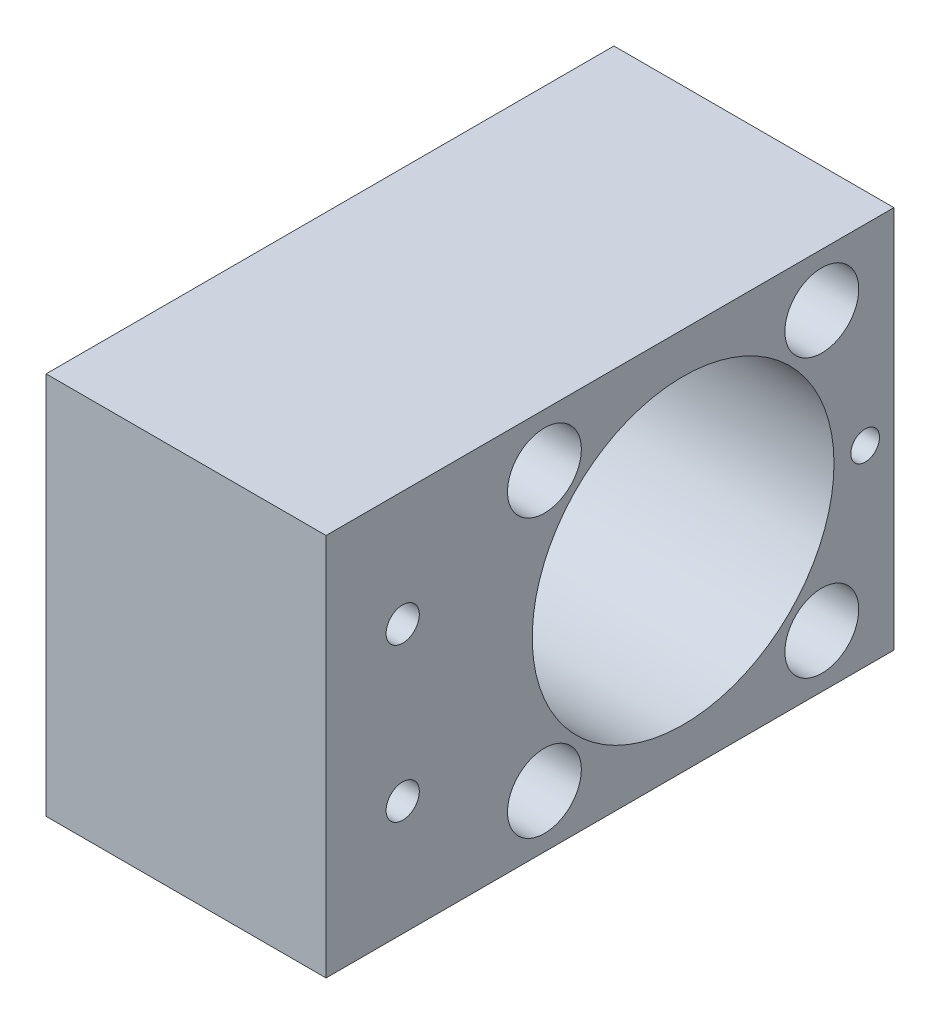
ISO-10303-21;
HEADER;
FILE_DESCRIPTION(('STEP AP214'),'2;1');
FILE_NAME('part.step','',(''),(''),'','','');
FILE_SCHEMA(('AUTOMOTIVE_DESIGN { 1 0 10303 214 1 1 1 1 }'));
ENDSEC;
DATA;
#1=APPLICATION_CONTEXT('core data for automotive mechanical design processes');
#2=APPLICATION_PROTOCOL_DEFINITION('international standard','automotive_design',2000,#1);
#3=PRODUCT_CONTEXT('',#1,'mechanical');
#4=PRODUCT('Part','Part','',(#3));
#5=PRODUCT_RELATED_PRODUCT_CATEGORY('part','',(#4));
#6=PRODUCT_DEFINITION_FORMATION('','',#4);
#7=PRODUCT_DEFINITION_CONTEXT('part definition',#1,'design');
#8=PRODUCT_DEFINITION('design','',#6,#7);
#9=PRODUCT_DEFINITION_SHAPE('','',#8);
#10=(LENGTH_UNIT() NAMED_UNIT(*) SI_UNIT(.MILLI.,.METRE.));
#11=(NAMED_UNIT(*) PLANE_ANGLE_UNIT() SI_UNIT($,.RADIAN.));
#12=(NAMED_UNIT(*) SI_UNIT($,.STERADIAN.) SOLID_ANGLE_UNIT());
#13=UNCERTAINTY_MEASURE_WITH_UNIT(LENGTH_MEASURE(1.E-05),#10,'distance_accuracy_value','');
#14=(GEOMETRIC_REPRESENTATION_CONTEXT(3) GLOBAL_UNCERTAINTY_ASSIGNED_CONTEXT((#13)) GLOBAL_UNIT_ASSIGNED_CONTEXT((#10,
#11,#12)) REPRESENTATION_CONTEXT('',''));
#15=CARTESIAN_POINT('',(0.,0.,0.));
#16=DIRECTION('',(0.,0.,1.));
#17=DIRECTION('',(1.,0.,0.));
#18=AXIS2_PLACEMENT_3D('',#15,#16,#17);
#19=CARTESIAN_POINT('',(-139.1281102758,269.617904210649,450.730144147963));
#20=DIRECTION('',(0.,1.,0.));
#21=DIRECTION('',(-1.,0.,0.));
#22=AXIS2_PLACEMENT_3D('',#19,#20,#21);
#23=PLANE('',#22);
#24=DIRECTION('',(0.,0.,1.));
#25=VECTOR('',#24,1.);
#26=CARTESIAN_POINT('',(-25.6169883433782,269.617904210649,450.730144147961));
#27=LINE('',#26,#25);
#28=CARTESIAN_POINT('',(-25.6169883433829,269.617904210649,201.272194935811));
#29=VERTEX_POINT('',#28);
#30=CARTESIAN_POINT('',(-25.6169883433808,269.617904210649,295.360051763123));
#31=VERTEX_POINT('',#30);
#32=EDGE_CURVE('E189',#29,#31,#27,.T.);
#33=ORIENTED_EDGE('',*,*,#32,.F.);
#34=DIRECTION('',(1.,0.,0.));
#35=VECTOR('',#34,1.);
#36=CARTESIAN_POINT('',(-139.128110275802,269.617904210649,201.272194935812));
#37=LINE('',#36,#35);
#38=CARTESIAN_POINT('',(20.7701366566122,269.617904210649,201.27219493581));
#39=VERTEX_POINT('',#38);
#40=EDGE_CURVE('E39',#29,#39,#37,.T.);
#41=ORIENTED_EDGE('',*,*,#40,.T.);
#42=DIRECTION('',(0.,0.,1.));
#43=VECTOR('',#42,1.);
#44=CARTESIAN_POINT('',(20.7701366566148,269.617904210649,450.730144147961));
#45=LINE('',#44,#43);
#46=CARTESIAN_POINT('',(20.7701366566132,269.617904210649,295.360051763122));
#47=VERTEX_POINT('',#46);
#48=EDGE_CURVE('E179',#39,#47,#45,.T.);
#49=ORIENTED_EDGE('',*,*,#48,.T.);
#50=DIRECTION('',(1.,0.,0.));
#51=VECTOR('',#50,1.);
#52=CARTESIAN_POINT('',(-139.128110275801,269.617904210649,295.360051763124));
#53=LINE('',#52,#51);
#54=EDGE_CURVE('E74',#31,#47,#53,.T.);
#55=ORIENTED_EDGE('',*,*,#54,.F.);
#56=EDGE_LOOP('',(#33,#41,#49,#55));
#57=FACE_BOUND('',#56,.T.);
#58=ADVANCED_FACE('F35',(#57),#23,.F.);
#59=CARTESIAN_POINT('',(-139.128110275801,31.4929042106494,295.360051763124));
#60=DIRECTION('',(0.,0.,-1.));
#61=DIRECTION('',(-1.,0.,0.));
#62=AXIS2_PLACEMENT_3D('',#59,#60,#61);
#63=PLANE('',#62);
#64=DIRECTION('',(0.,1.,0.));
#65=VECTOR('',#64,1.);
#66=CARTESIAN_POINT('',(-25.616988343384,31.492904210648,295.360051763123));
#67=LINE('',#66,#65);
#68=CARTESIAN_POINT('',(-25.6169883433813,333.117904210649,295.360051763123));
#69=VERTEX_POINT('',#68);
#70=EDGE_CURVE('E44',#31,#69,#67,.T.);
#71=ORIENTED_EDGE('',*,*,#70,.F.);
#72=ORIENTED_EDGE('',*,*,#54,.T.);
#73=DIRECTION('',(0.,1.,0.));
#74=VECTOR('',#73,1.);
#75=CARTESIAN_POINT('',(20.7701366566132,31.4929042106494,295.360051763122));
#76=LINE('',#75,#74);
#77=CARTESIAN_POINT('',(20.7701366566131,333.117904210649,295.360051763122));
#78=VERTEX_POINT('',#77);
#79=EDGE_CURVE('E177',#47,#78,#76,.T.);
#80=ORIENTED_EDGE('',*,*,#79,.T.);
#81=DIRECTION('',(1.,0.,0.));
#82=VECTOR('',#81,1.);
#83=CARTESIAN_POINT('',(-139.128110275801,333.117904210649,295.360051763124));
#84=LINE('',#83,#82);
#85=EDGE_CURVE('E176',#69,#78,#84,.T.);
#86=ORIENTED_EDGE('',*,*,#85,.F.);
#87=EDGE_LOOP('',(#71,#72,#80,#86));
#88=FACE_BOUND('',#87,.T.);
#89=ADVANCED_FACE('F199',(#88),#63,.F.);
#90=CARTESIAN_POINT('',(-139.1281102758,333.117904210649,450.730144147963));
#91=DIRECTION('',(0.,-1.,0.));
#92=DIRECTION('',(1.,0.,0.));
#93=AXIS2_PLACEMENT_3D('',#90,#91,#92);
#94=PLANE('',#93);
#95=DIRECTION('',(0.,0.,-1.));
#96=VECTOR('',#95,1.);
#97=CARTESIAN_POINT('',(-25.6169883433775,333.117904210649,450.730144147961));
#98=LINE('',#97,#96);
#99=CARTESIAN_POINT('',(-25.6169883433826,333.117904210649,201.272194935811));
#100=VERTEX_POINT('',#99);
#101=EDGE_CURVE('E11',#69,#100,#98,.T.);
#102=ORIENTED_EDGE('',*,*,#101,.F.);
#103=ORIENTED_EDGE('',*,*,#85,.T.);
#104=DIRECTION('',(0.,0.,-1.));
#105=VECTOR('',#104,1.);
#106=CARTESIAN_POINT('',(20.7701366566148,333.117904210649,450.730144147961));
#107=LINE('',#106,#105);
#108=CARTESIAN_POINT('',(20.7701366566122,333.117904210649,201.27219493581));
#109=VERTEX_POINT('',#108);
#110=EDGE_CURVE('E174',#78,#109,#107,.T.);
#111=ORIENTED_EDGE('',*,*,#110,.T.);
#112=DIRECTION('',(1.,0.,0.));
#113=VECTOR('',#112,1.);
#114=CARTESIAN_POINT('',(-139.128110275802,333.117904210649,201.272194935812));
#115=LINE('',#114,#113);
#116=EDGE_CURVE('E57',#100,#109,#115,.T.);
#117=ORIENTED_EDGE('',*,*,#116,.F.);
#118=EDGE_LOOP('',(#102,#103,#111,#117));
#119=FACE_BOUND('',#118,.T.);
#120=ADVANCED_FACE('F196',(#119),#94,.F.);
#121=CARTESIAN_POINT('',(-139.128110275802,31.4929042106494,201.272194935812));
#122=DIRECTION('',(0.,0.,1.));
#123=DIRECTION('',(1.,0.,0.));
#124=AXIS2_PLACEMENT_3D('',#121,#122,#123);
#125=PLANE('',#124);
#126=DIRECTION('',(0.,-1.,0.));
#127=VECTOR('',#126,1.);
#128=CARTESIAN_POINT('',(-25.6169883433858,31.492904210648,201.272194935811));
#129=LINE('',#128,#127);
#130=EDGE_CURVE('E186',#100,#29,#129,.T.);
#131=ORIENTED_EDGE('',*,*,#130,.F.);
#132=ORIENTED_EDGE('',*,*,#116,.T.);
#133=DIRECTION('',(0.,-1.,0.));
#134=VECTOR('',#133,1.);
#135=CARTESIAN_POINT('',(20.7701366566122,31.4929042106494,201.27219493581));
#136=LINE('',#135,#134);
#137=EDGE_CURVE('E171',#109,#39,#136,.T.);
#138=ORIENTED_EDGE('',*,*,#137,.T.);
#139=ORIENTED_EDGE('',*,*,#40,.F.);
#140=EDGE_LOOP('',(#131,#132,#138,#139));
#141=FACE_BOUND('',#140,.T.);
#142=ADVANCED_FACE('F203',(#141),#125,.F.);
#143=CARTESIAN_POINT('',(-139.128110275802,301.367904210649,236.197194935812));
#144=DIRECTION('',(1.,0.,0.));
#145=DIRECTION('',(0.,0.,-1.));
#146=AXIS2_PLACEMENT_3D('',#143,#144,#145);
#147=CYLINDRICAL_SURFACE('',#146,25.);
#148=CARTESIAN_POINT('',(20.7701366566125,301.367904210649,236.19719493581));
#149=DIRECTION('',(1.,0.,0.));
#150=DIRECTION('',(0.,0.,-1.));
#151=AXIS2_PLACEMENT_3D('',#148,#149,#150);
#152=CIRCLE('',#151,25.);
#153=CARTESIAN_POINT('',(20.7701366566123,301.367904210649,211.19719493581));
#154=VERTEX_POINT('',#153);
#155=EDGE_CURVE('E173',#154,#154,#152,.T.);
#156=ORIENTED_EDGE('',*,*,#155,.T.);
#157=EDGE_LOOP('',(#156));
#158=FACE_BOUND('',#157,.T.);
#159=CARTESIAN_POINT('',(-25.6169883433819,301.367904210649,236.197194935811));
#160=DIRECTION('',(-1.,0.,0.));
#161=DIRECTION('',(0.,0.,1.));
#162=AXIS2_PLACEMENT_3D('',#159,#160,#161);
#163=CIRCLE('',#162,25.);
#164=CARTESIAN_POINT('',(-25.6169883433814,301.367904210649,261.197194935811));
#165=VERTEX_POINT('',#164);
#166=EDGE_CURVE('E184',#165,#165,#163,.F.);
#167=ORIENTED_EDGE('',*,*,#166,.F.);
#168=EDGE_LOOP('',(#167));
#169=FACE_BOUND('',#168,.T.);
#170=ADVANCED_FACE('F205',(#158,#169),#147,.F.);
#171=CARTESIAN_POINT('',(20.7701366566101,0.,-2.18969740989699E-13));
#172=DIRECTION('',(-1.,0.,0.));
#173=DIRECTION('',(0.,0.,1.));
#174=AXIS2_PLACEMENT_3D('',#171,#172,#173);
#175=PLANE('',#174);
#176=CARTESIAN_POINT('',(20.7701366566122,301.367904210649,206.034694935811));
#177=DIRECTION('',(1.,0.,0.));
#178=DIRECTION('',(0.,0.,-1.));
#179=AXIS2_PLACEMENT_3D('',#176,#177,#178);
#180=CIRCLE('',#179,2.38125);
#181=CARTESIAN_POINT('',(20.7701366566122,301.367904210649,203.653444935811));
#182=VERTEX_POINT('',#181);
#183=EDGE_CURVE('E95',#182,#182,#180,.T.);
#184=ORIENTED_EDGE('',*,*,#183,.F.);
#185=EDGE_LOOP('',(#184));
#186=FACE_BOUND('',#185,.T.);
#187=CARTESIAN_POINT('',(20.7701366566152,314.06790421065,282.660051763122));
#188=DIRECTION('',(-1.,0.,0.));
#189=DIRECTION('',(0.,0.,1.));
#190=AXIS2_PLACEMENT_3D('',#187,#188,#189);
#191=CIRCLE('',#190,2.74999999999997);
#192=CARTESIAN_POINT('',(20.7701366566153,314.06790421065,285.410051763122));
#193=VERTEX_POINT('',#192);
#194=EDGE_CURVE('E108',#193,#193,#191,.T.);
#195=ORIENTED_EDGE('',*,*,#194,.T.);
#196=EDGE_LOOP('',(#195));
#197=FACE_BOUND('',#196,.T.);
#198=CARTESIAN_POINT('',(20.7701366566149,288.66790421065,282.660051763122));
#199=DIRECTION('',(-1.,0.,0.));
#200=DIRECTION('',(0.,0.,1.));
#201=AXIS2_PLACEMENT_3D('',#198,#199,#200);
#202=CIRCLE('',#201,2.74999999999997);
#203=CARTESIAN_POINT('',(20.770136656615,288.66790421065,285.410051763122));
#204=VERTEX_POINT('',#203);
#205=EDGE_CURVE('E120',#204,#204,#202,.T.);
#206=ORIENTED_EDGE('',*,*,#205,.T.);
#207=EDGE_LOOP('',(#206));
#208=FACE_BOUND('',#207,.T.);
#209=CARTESIAN_POINT('',(20.7701366566128,324.34887459921,259.178165324371));
#210=DIRECTION('',(1.,0.,0.));
#211=DIRECTION('',(0.,0.,-1.));
#212=AXIS2_PLACEMENT_3D('',#209,#210,#211);
#213=CIRCLE('',#212,6.12000000000001);
#214=CARTESIAN_POINT('',(20.7701366566127,324.34887459921,253.058165324371));
#215=VERTEX_POINT('',#214);
#216=EDGE_CURVE('E123',#215,#215,#213,.T.);
#217=ORIENTED_EDGE('',*,*,#216,.F.);
#218=EDGE_LOOP('',(#217));
#219=FACE_BOUND('',#218,.T.);
#220=CARTESIAN_POINT('',(20.7701366566128,278.38693382209,259.178165324371));
#221=DIRECTION('',(1.,0.,0.));
#222=DIRECTION('',(0.,0.,-1.));
#223=AXIS2_PLACEMENT_3D('',#220,#221,#222);
#224=CIRCLE('',#223,6.12000000000001);
#225=CARTESIAN_POINT('',(20.7701366566127,278.38693382209,253.058165324371));
#226=VERTEX_POINT('',#225);
#227=EDGE_CURVE('E135',#226,#226,#224,.T.);
#228=ORIENTED_EDGE('',*,*,#227,.F.);
#229=EDGE_LOOP('',(#228));
#230=FACE_BOUND('',#229,.T.);
#231=CARTESIAN_POINT('',(20.7701366566123,278.38693382209,213.21622454725));
#232=DIRECTION('',(1.,0.,0.));
#233=DIRECTION('',(0.,0.,-1.));
#234=AXIS2_PLACEMENT_3D('',#231,#232,#233);
#235=CIRCLE('',#234,6.12000000000001);
#236=CARTESIAN_POINT('',(20.7701366566122,278.38693382209,207.09622454725));
#237=VERTEX_POINT('',#236);
#238=EDGE_CURVE('E147',#237,#237,#235,.T.);
#239=ORIENTED_EDGE('',*,*,#238,.F.);
#240=EDGE_LOOP('',(#239));
#241=FACE_BOUND('',#240,.T.);
#242=CARTESIAN_POINT('',(20.7701366566123,324.34887459921,213.216224547251));
#243=DIRECTION('',(1.,0.,0.));
#244=DIRECTION('',(0.,0.,-1.));
#245=AXIS2_PLACEMENT_3D('',#242,#243,#244);
#246=CIRCLE('',#245,6.12000000000001);
#247=CARTESIAN_POINT('',(20.7701366566122,324.34887459921,207.096224547251));
#248=VERTEX_POINT('',#247);
#249=EDGE_CURVE('E159',#248,#248,#246,.T.);
#250=ORIENTED_EDGE('',*,*,#249,.F.);
#251=EDGE_LOOP('',(#250));
#252=FACE_BOUND('',#251,.T.);
#253=ORIENTED_EDGE('',*,*,#155,.F.);
#254=EDGE_LOOP('',(#253));
#255=FACE_BOUND('',#254,.T.);
#256=ORIENTED_EDGE('',*,*,#48,.F.);
#257=ORIENTED_EDGE('',*,*,#137,.F.);
#258=ORIENTED_EDGE('',*,*,#110,.F.);
#259=ORIENTED_EDGE('',*,*,#79,.F.);
#260=EDGE_LOOP('',(#256,#257,#258,#259));
#261=FACE_BOUND('',#260,.T.);
#262=ADVANCED_FACE('F202',(#186,#197,#208,#219,#230,#241,#252,#255,#261),#175,.F.);
#263=CARTESIAN_POINT('',(-25.6169883433819,301.36790421065,236.197194935811));
#264=DIRECTION('',(-1.,0.,0.));
#265=DIRECTION('',(0.,0.,-1.));
#266=AXIS2_PLACEMENT_3D('',#263,#264,#265);
#267=PLANE('',#266);
#268=CARTESIAN_POINT('',(-25.6169883433809,314.06790421065,282.660051763123));
#269=DIRECTION('',(-1.,0.,0.));
#270=DIRECTION('',(0.,0.,1.));
#271=AXIS2_PLACEMENT_3D('',#268,#269,#270);
#272=CIRCLE('',#271,6.12000000000001);
#273=CARTESIAN_POINT('',(-25.6169883433808,314.06790421065,288.780051763123));
#274=VERTEX_POINT('',#273);
#275=EDGE_CURVE('E94',#274,#274,#272,.T.);
#276=ORIENTED_EDGE('',*,*,#275,.F.);
#277=EDGE_LOOP('',(#276));
#278=FACE_BOUND('',#277,.T.);
#279=CARTESIAN_POINT('',(-25.6169883433812,288.66790421065,282.660051763123));
#280=DIRECTION('',(-1.,0.,0.));
#281=DIRECTION('',(0.,0.,1.));
#282=AXIS2_PLACEMENT_3D('',#279,#280,#281);
#283=CIRCLE('',#282,6.12000000000001);
#284=CARTESIAN_POINT('',(-25.6169883433811,288.66790421065,288.780051763123));
#285=VERTEX_POINT('',#284);
#286=EDGE_CURVE('E111',#285,#285,#283,.T.);
#287=ORIENTED_EDGE('',*,*,#286,.F.);
#288=EDGE_LOOP('',(#287));
#289=FACE_BOUND('',#288,.T.);
#290=CARTESIAN_POINT('',(-25.6169883433833,324.34887459921,259.178165324371));
#291=DIRECTION('',(1.,0.,0.));
#292=DIRECTION('',(0.,0.,-1.));
#293=AXIS2_PLACEMENT_3D('',#290,#291,#292);
#294=CIRCLE('',#293,2.74999999999997);
#295=CARTESIAN_POINT('',(-25.6169883433834,324.34887459921,256.428165324371));
#296=VERTEX_POINT('',#295);
#297=EDGE_CURVE('E132',#296,#296,#294,.T.);
#298=ORIENTED_EDGE('',*,*,#297,.T.);
#299=EDGE_LOOP('',(#298));
#300=FACE_BOUND('',#299,.T.);
#301=CARTESIAN_POINT('',(-25.6169883433833,278.38693382209,259.178165324371));
#302=DIRECTION('',(1.,0.,0.));
#303=DIRECTION('',(0.,0.,-1.));
#304=AXIS2_PLACEMENT_3D('',#301,#302,#303);
#305=CIRCLE('',#304,2.74999999999997);
#306=CARTESIAN_POINT('',(-25.6169883433834,278.38693382209,256.428165324371));
#307=VERTEX_POINT('',#306);
#308=EDGE_CURVE('E144',#307,#307,#305,.T.);
#309=ORIENTED_EDGE('',*,*,#308,.T.);
#310=EDGE_LOOP('',(#309));
#311=FACE_BOUND('',#310,.T.);
#312=CARTESIAN_POINT('',(-25.6169883433838,278.38693382209,213.216224547251));
#313=DIRECTION('',(1.,0.,0.));
#314=DIRECTION('',(0.,0.,-1.));
#315=AXIS2_PLACEMENT_3D('',#312,#313,#314);
#316=CIRCLE('',#315,2.74999999999997);
#317=CARTESIAN_POINT('',(-25.6169883433838,278.38693382209,210.466224547251));
#318=VERTEX_POINT('',#317);
#319=EDGE_CURVE('E156',#318,#318,#316,.T.);
#320=ORIENTED_EDGE('',*,*,#319,.T.);
#321=EDGE_LOOP('',(#320));
#322=FACE_BOUND('',#321,.T.);
#323=CARTESIAN_POINT('',(-25.6169883433838,324.34887459921,213.216224547251));
#324=DIRECTION('',(1.,0.,0.));
#325=DIRECTION('',(0.,0.,-1.));
#326=AXIS2_PLACEMENT_3D('',#323,#324,#325);
#327=CIRCLE('',#326,2.74999999999997);
#328=CARTESIAN_POINT('',(-25.6169883433838,324.34887459921,210.466224547251));
#329=VERTEX_POINT('',#328);
#330=EDGE_CURVE('E168',#329,#329,#327,.T.);
#331=ORIENTED_EDGE('',*,*,#330,.T.);
#332=EDGE_LOOP('',(#331));
#333=FACE_BOUND('',#332,.T.);
#334=ORIENTED_EDGE('',*,*,#166,.T.);
#335=EDGE_LOOP('',(#334));
#336=FACE_BOUND('',#335,.T.);
#337=ORIENTED_EDGE('',*,*,#130,.T.);
#338=ORIENTED_EDGE('',*,*,#32,.T.);
#339=ORIENTED_EDGE('',*,*,#70,.T.);
#340=ORIENTED_EDGE('',*,*,#101,.T.);
#341=EDGE_LOOP('',(#337,#338,#339,#340));
#342=FACE_BOUND('',#341,.T.);
#343=ADVANCED_FACE('F37',(#278,#289,#300,#311,#322,#333,#336,#342),#267,.T.);
#344=CARTESIAN_POINT('',(20.7701366566123,324.34887459921,213.216224547251));
#345=DIRECTION('',(1.,0.,0.));
#346=DIRECTION('',(0.,0.,-1.));
#347=AXIS2_PLACEMENT_3D('',#344,#345,#346);
#348=CYLINDRICAL_SURFACE('',#347,2.75);
#349=ORIENTED_EDGE('',*,*,#330,.F.);
#350=EDGE_LOOP('',(#349));
#351=FACE_BOUND('',#350,.T.);
#352=CARTESIAN_POINT('',(10.7701366566123,324.34887459921,213.216224547251));
#353=DIRECTION('',(1.,0.,0.));
#354=DIRECTION('',(0.,0.,-1.));
#355=AXIS2_PLACEMENT_3D('',#352,#353,#354);
#356=CIRCLE('',#355,2.75000000000003);
#357=CARTESIAN_POINT('',(10.7701366566122,324.34887459921,210.466224547251));
#358=VERTEX_POINT('',#357);
#359=EDGE_CURVE('E165',#358,#358,#356,.T.);
#360=ORIENTED_EDGE('',*,*,#359,.T.);
#361=EDGE_LOOP('',(#360));
#362=FACE_BOUND('',#361,.T.);
#363=ADVANCED_FACE('F223',(#351,#362),#348,.F.);
#364=CARTESIAN_POINT('',(10.7701366566123,327.09887459921,213.216224547251));
#365=DIRECTION('',(-1.,0.,0.));
#366=DIRECTION('',(0.,0.,1.));
#367=AXIS2_PLACEMENT_3D('',#364,#365,#366);
#368=PLANE('',#367);
#369=ORIENTED_EDGE('',*,*,#359,.F.);
#370=EDGE_LOOP('',(#369));
#371=FACE_BOUND('',#370,.T.);
#372=CARTESIAN_POINT('',(10.7701366566123,324.34887459921,213.216224547251));
#373=DIRECTION('',(1.,0.,0.));
#374=DIRECTION('',(0.,0.,-1.));
#375=AXIS2_PLACEMENT_3D('',#372,#373,#374);
#376=CIRCLE('',#375,6.12000000000001);
#377=CARTESIAN_POINT('',(10.7701366566122,324.34887459921,207.096224547251));
#378=VERTEX_POINT('',#377);
#379=EDGE_CURVE('E162',#378,#378,#376,.T.);
#380=ORIENTED_EDGE('',*,*,#379,.T.);
#381=EDGE_LOOP('',(#380));
#382=FACE_BOUND('',#381,.T.);
#383=ADVANCED_FACE('F229',(#371,#382),#368,.F.);
#384=CARTESIAN_POINT('',(20.7701366566123,324.34887459921,213.216224547251));
#385=DIRECTION('',(1.,0.,0.));
#386=DIRECTION('',(0.,0.,-1.));
#387=AXIS2_PLACEMENT_3D('',#384,#385,#386);
#388=CYLINDRICAL_SURFACE('',#387,6.12000000000001);
#389=ORIENTED_EDGE('',*,*,#379,.F.);
#390=EDGE_LOOP('',(#389));
#391=FACE_BOUND('',#390,.T.);
#392=ORIENTED_EDGE('',*,*,#249,.T.);
#393=EDGE_LOOP('',(#392));
#394=FACE_BOUND('',#393,.T.);
#395=ADVANCED_FACE('F252',(#391,#394),#388,.F.);
#396=CARTESIAN_POINT('',(20.7701366566123,278.38693382209,213.21622454725));
#397=DIRECTION('',(1.,0.,0.));
#398=DIRECTION('',(0.,0.,-1.));
#399=AXIS2_PLACEMENT_3D('',#396,#397,#398);
#400=CYLINDRICAL_SURFACE('',#399,2.74999999999997);
#401=ORIENTED_EDGE('',*,*,#319,.F.);
#402=EDGE_LOOP('',(#401));
#403=FACE_BOUND('',#402,.T.);
#404=CARTESIAN_POINT('',(10.7701366566123,278.38693382209,213.216224547251));
#405=DIRECTION('',(1.,0.,0.));
#406=DIRECTION('',(0.,0.,-1.));
#407=AXIS2_PLACEMENT_3D('',#404,#405,#406);
#408=CIRCLE('',#407,2.74999999999997);
#409=CARTESIAN_POINT('',(10.7701366566123,278.38693382209,210.466224547251));
#410=VERTEX_POINT('',#409);
#411=EDGE_CURVE('E153',#410,#410,#408,.T.);
#412=ORIENTED_EDGE('',*,*,#411,.T.);
#413=EDGE_LOOP('',(#412));
#414=FACE_BOUND('',#413,.T.);
#415=ADVANCED_FACE('F258',(#403,#414),#400,.F.);
#416=CARTESIAN_POINT('',(10.7701366566123,281.13693382209,213.216224547251));
#417=DIRECTION('',(-1.,0.,0.));
#418=DIRECTION('',(0.,0.,1.));
#419=AXIS2_PLACEMENT_3D('',#416,#417,#418);
#420=PLANE('',#419);
#421=ORIENTED_EDGE('',*,*,#411,.F.);
#422=EDGE_LOOP('',(#421));
#423=FACE_BOUND('',#422,.T.);
#424=CARTESIAN_POINT('',(10.7701366566123,278.38693382209,213.216224547251));
#425=DIRECTION('',(1.,0.,0.));
#426=DIRECTION('',(0.,0.,-1.));
#427=AXIS2_PLACEMENT_3D('',#424,#425,#426);
#428=CIRCLE('',#427,6.12000000000001);
#429=CARTESIAN_POINT('',(10.7701366566122,278.38693382209,207.096224547251));
#430=VERTEX_POINT('',#429);
#431=EDGE_CURVE('E150',#430,#430,#428,.T.);
#432=ORIENTED_EDGE('',*,*,#431,.T.);
#433=EDGE_LOOP('',(#432));
#434=FACE_BOUND('',#433,.T.);
#435=ADVANCED_FACE('F267',(#423,#434),#420,.F.);
#436=CARTESIAN_POINT('',(20.7701366566123,278.38693382209,213.21622454725));
#437=DIRECTION('',(1.,0.,0.));
#438=DIRECTION('',(0.,0.,-1.));
#439=AXIS2_PLACEMENT_3D('',#436,#437,#438);
#440=CYLINDRICAL_SURFACE('',#439,6.12000000000001);
#441=ORIENTED_EDGE('',*,*,#431,.F.);
#442=EDGE_LOOP('',(#441));
#443=FACE_BOUND('',#442,.T.);
#444=ORIENTED_EDGE('',*,*,#238,.T.);
#445=EDGE_LOOP('',(#444));
#446=FACE_BOUND('',#445,.T.);
#447=ADVANCED_FACE('F273',(#443,#446),#440,.F.);
#448=CARTESIAN_POINT('',(20.7701366566128,278.38693382209,259.178165324371));
#449=DIRECTION('',(1.,0.,0.));
#450=DIRECTION('',(0.,0.,-1.));
#451=AXIS2_PLACEMENT_3D('',#448,#449,#450);
#452=CYLINDRICAL_SURFACE('',#451,2.74999999999997);
#453=ORIENTED_EDGE('',*,*,#308,.F.);
#454=EDGE_LOOP('',(#453));
#455=FACE_BOUND('',#454,.T.);
#456=CARTESIAN_POINT('',(10.7701366566128,278.38693382209,259.178165324371));
#457=DIRECTION('',(1.,0.,0.));
#458=DIRECTION('',(0.,0.,-1.));
#459=AXIS2_PLACEMENT_3D('',#456,#457,#458);
#460=CIRCLE('',#459,2.74999999999997);
#461=CARTESIAN_POINT('',(10.7701366566127,278.38693382209,256.428165324371));
#462=VERTEX_POINT('',#461);
#463=EDGE_CURVE('E141',#462,#462,#460,.T.);
#464=ORIENTED_EDGE('',*,*,#463,.T.);
#465=EDGE_LOOP('',(#464));
#466=FACE_BOUND('',#465,.T.);
#467=ADVANCED_FACE('F277',(#455,#466),#452,.F.);
#468=CARTESIAN_POINT('',(10.7701366566128,281.13693382209,259.178165324371));
#469=DIRECTION('',(-1.,0.,0.));
#470=DIRECTION('',(0.,0.,1.));
#471=AXIS2_PLACEMENT_3D('',#468,#469,#470);
#472=PLANE('',#471);
#473=ORIENTED_EDGE('',*,*,#463,.F.);
#474=EDGE_LOOP('',(#473));
#475=FACE_BOUND('',#474,.T.);
#476=CARTESIAN_POINT('',(10.7701366566128,278.38693382209,259.178165324371));
#477=DIRECTION('',(1.,0.,0.));
#478=DIRECTION('',(0.,0.,-1.));
#479=AXIS2_PLACEMENT_3D('',#476,#477,#478);
#480=CIRCLE('',#479,6.12000000000001);
#481=CARTESIAN_POINT('',(10.7701366566127,278.38693382209,253.058165324371));
#482=VERTEX_POINT('',#481);
#483=EDGE_CURVE('E138',#482,#482,#480,.T.);
#484=ORIENTED_EDGE('',*,*,#483,.T.);
#485=EDGE_LOOP('',(#484));
#486=FACE_BOUND('',#485,.T.);
#487=ADVANCED_FACE('F281',(#475,#486),#472,.F.);
#488=CARTESIAN_POINT('',(20.7701366566128,278.38693382209,259.178165324371));
#489=DIRECTION('',(1.,0.,0.));
#490=DIRECTION('',(0.,0.,-1.));
#491=AXIS2_PLACEMENT_3D('',#488,#489,#490);
#492=CYLINDRICAL_SURFACE('',#491,6.12000000000001);
#493=ORIENTED_EDGE('',*,*,#483,.F.);
#494=EDGE_LOOP('',(#493));
#495=FACE_BOUND('',#494,.T.);
#496=ORIENTED_EDGE('',*,*,#227,.T.);
#497=EDGE_LOOP('',(#496));
#498=FACE_BOUND('',#497,.T.);
#499=ADVANCED_FACE('F285',(#495,#498),#492,.F.);
#500=CARTESIAN_POINT('',(20.7701366566128,324.34887459921,259.178165324371));
#501=DIRECTION('',(1.,0.,0.));
#502=DIRECTION('',(0.,0.,-1.));
#503=AXIS2_PLACEMENT_3D('',#500,#501,#502);
#504=CYLINDRICAL_SURFACE('',#503,2.74999999999997);
#505=ORIENTED_EDGE('',*,*,#297,.F.);
#506=EDGE_LOOP('',(#505));
#507=FACE_BOUND('',#506,.T.);
#508=CARTESIAN_POINT('',(10.7701366566128,324.34887459921,259.178165324371));
#509=DIRECTION('',(1.,0.,0.));
#510=DIRECTION('',(0.,0.,-1.));
#511=AXIS2_PLACEMENT_3D('',#508,#509,#510);
#512=CIRCLE('',#511,2.74999999999997);
#513=CARTESIAN_POINT('',(10.7701366566127,324.34887459921,256.428165324371));
#514=VERTEX_POINT('',#513);
#515=EDGE_CURVE('E129',#514,#514,#512,.T.);
#516=ORIENTED_EDGE('',*,*,#515,.T.);
#517=EDGE_LOOP('',(#516));
#518=FACE_BOUND('',#517,.T.);
#519=ADVANCED_FACE('F289',(#507,#518),#504,.F.);
#520=CARTESIAN_POINT('',(10.7701366566128,327.09887459921,259.178165324371));
#521=DIRECTION('',(-1.,0.,0.));
#522=DIRECTION('',(0.,0.,1.));
#523=AXIS2_PLACEMENT_3D('',#520,#521,#522);
#524=PLANE('',#523);
#525=ORIENTED_EDGE('',*,*,#515,.F.);
#526=EDGE_LOOP('',(#525));
#527=FACE_BOUND('',#526,.T.);
#528=CARTESIAN_POINT('',(10.7701366566128,324.34887459921,259.178165324371));
#529=DIRECTION('',(1.,0.,0.));
#530=DIRECTION('',(0.,0.,-1.));
#531=AXIS2_PLACEMENT_3D('',#528,#529,#530);
#532=CIRCLE('',#531,6.12000000000001);
#533=CARTESIAN_POINT('',(10.7701366566127,324.34887459921,253.058165324371));
#534=VERTEX_POINT('',#533);
#535=EDGE_CURVE('E126',#534,#534,#532,.T.);
#536=ORIENTED_EDGE('',*,*,#535,.T.);
#537=EDGE_LOOP('',(#536));
#538=FACE_BOUND('',#537,.T.);
#539=ADVANCED_FACE('F293',(#527,#538),#524,.F.);
#540=CARTESIAN_POINT('',(20.7701366566128,324.34887459921,259.178165324371));
#541=DIRECTION('',(1.,0.,0.));
#542=DIRECTION('',(0.,0.,-1.));
#543=AXIS2_PLACEMENT_3D('',#540,#541,#542);
#544=CYLINDRICAL_SURFACE('',#543,6.12000000000001);
#545=ORIENTED_EDGE('',*,*,#535,.F.);
#546=EDGE_LOOP('',(#545));
#547=FACE_BOUND('',#546,.T.);
#548=ORIENTED_EDGE('',*,*,#216,.T.);
#549=EDGE_LOOP('',(#548));
#550=FACE_BOUND('',#549,.T.);
#551=ADVANCED_FACE('F297',(#547,#550),#544,.F.);
#552=CARTESIAN_POINT('',(-25.6169883433812,288.66790421065,282.660051763123));
#553=DIRECTION('',(-1.,0.,0.));
#554=DIRECTION('',(0.,0.,1.));
#555=AXIS2_PLACEMENT_3D('',#552,#553,#554);
#556=CYLINDRICAL_SURFACE('',#555,2.75);
#557=ORIENTED_EDGE('',*,*,#205,.F.);
#558=EDGE_LOOP('',(#557));
#559=FACE_BOUND('',#558,.T.);
#560=CARTESIAN_POINT('',(-15.6169883433812,288.66790421065,282.660051763123));
#561=DIRECTION('',(-1.,0.,0.));
#562=DIRECTION('',(0.,0.,1.));
#563=AXIS2_PLACEMENT_3D('',#560,#561,#562);
#564=CIRCLE('',#563,2.75000000000003);
#565=CARTESIAN_POINT('',(-15.6169883433811,288.66790421065,285.410051763123));
#566=VERTEX_POINT('',#565);
#567=EDGE_CURVE('E117',#566,#566,#564,.T.);
#568=ORIENTED_EDGE('',*,*,#567,.T.);
#569=EDGE_LOOP('',(#568));
#570=FACE_BOUND('',#569,.T.);
#571=ADVANCED_FACE('F301',(#559,#570),#556,.F.);
#572=CARTESIAN_POINT('',(-15.6169883433812,291.41790421065,282.660051763123));
#573=DIRECTION('',(1.,0.,0.));
#574=DIRECTION('',(0.,0.,-1.));
#575=AXIS2_PLACEMENT_3D('',#572,#573,#574);
#576=PLANE('',#575);
#577=ORIENTED_EDGE('',*,*,#567,.F.);
#578=EDGE_LOOP('',(#577));
#579=FACE_BOUND('',#578,.T.);
#580=CARTESIAN_POINT('',(-15.6169883433812,288.66790421065,282.660051763123));
#581=DIRECTION('',(-1.,0.,0.));
#582=DIRECTION('',(0.,0.,1.));
#583=AXIS2_PLACEMENT_3D('',#580,#581,#582);
#584=CIRCLE('',#583,6.12000000000001);
#585=CARTESIAN_POINT('',(-15.6169883433811,288.66790421065,288.780051763123));
#586=VERTEX_POINT('',#585);
#587=EDGE_CURVE('E114',#586,#586,#584,.T.);
#588=ORIENTED_EDGE('',*,*,#587,.T.);
#589=EDGE_LOOP('',(#588));
#590=FACE_BOUND('',#589,.T.);
#591=ADVANCED_FACE('F305',(#579,#590),#576,.F.);
#592=CARTESIAN_POINT('',(-25.6169883433812,288.66790421065,282.660051763123));
#593=DIRECTION('',(-1.,0.,0.));
#594=DIRECTION('',(0.,0.,1.));
#595=AXIS2_PLACEMENT_3D('',#592,#593,#594);
#596=CYLINDRICAL_SURFACE('',#595,6.12000000000001);
#597=ORIENTED_EDGE('',*,*,#587,.F.);
#598=EDGE_LOOP('',(#597));
#599=FACE_BOUND('',#598,.T.);
#600=ORIENTED_EDGE('',*,*,#286,.T.);
#601=EDGE_LOOP('',(#600));
#602=FACE_BOUND('',#601,.T.);
#603=ADVANCED_FACE('F309',(#599,#602),#596,.F.);
#604=CARTESIAN_POINT('',(-25.6169883433809,314.06790421065,282.660051763123));
#605=DIRECTION('',(-1.,0.,0.));
#606=DIRECTION('',(0.,0.,1.));
#607=AXIS2_PLACEMENT_3D('',#604,#605,#606);
#608=CYLINDRICAL_SURFACE('',#607,2.74999999999997);
#609=ORIENTED_EDGE('',*,*,#194,.F.);
#610=EDGE_LOOP('',(#609));
#611=FACE_BOUND('',#610,.T.);
#612=CARTESIAN_POINT('',(-15.6169883433809,314.06790421065,282.660051763123));
#613=DIRECTION('',(-1.,0.,0.));
#614=DIRECTION('',(0.,0.,1.));
#615=AXIS2_PLACEMENT_3D('',#612,#613,#614);
#616=CIRCLE('',#615,2.74999999999997);
#617=CARTESIAN_POINT('',(-15.6169883433808,314.06790421065,285.410051763123));
#618=VERTEX_POINT('',#617);
#619=EDGE_CURVE('E105',#618,#618,#616,.T.);
#620=ORIENTED_EDGE('',*,*,#619,.T.);
#621=EDGE_LOOP('',(#620));
#622=FACE_BOUND('',#621,.T.);
#623=ADVANCED_FACE('F313',(#611,#622),#608,.F.);
#624=CARTESIAN_POINT('',(-15.6169883433809,316.81790421065,282.660051763123));
#625=DIRECTION('',(1.,0.,0.));
#626=DIRECTION('',(0.,0.,-1.));
#627=AXIS2_PLACEMENT_3D('',#624,#625,#626);
#628=PLANE('',#627);
#629=ORIENTED_EDGE('',*,*,#619,.F.);
#630=EDGE_LOOP('',(#629));
#631=FACE_BOUND('',#630,.T.);
#632=CARTESIAN_POINT('',(-15.6169883433809,314.06790421065,282.660051763123));
#633=DIRECTION('',(-1.,0.,0.));
#634=DIRECTION('',(0.,0.,1.));
#635=AXIS2_PLACEMENT_3D('',#632,#633,#634);
#636=CIRCLE('',#635,6.12000000000001);
#637=CARTESIAN_POINT('',(-15.6169883433808,314.06790421065,288.780051763123));
#638=VERTEX_POINT('',#637);
#639=EDGE_CURVE('E98',#638,#638,#636,.T.);
#640=ORIENTED_EDGE('',*,*,#639,.T.);
#641=EDGE_LOOP('',(#640));
#642=FACE_BOUND('',#641,.T.);
#643=ADVANCED_FACE('F317',(#631,#642),#628,.F.);
#644=CARTESIAN_POINT('',(-25.6169883433809,314.06790421065,282.660051763123));
#645=DIRECTION('',(-1.,0.,0.));
#646=DIRECTION('',(0.,0.,1.));
#647=AXIS2_PLACEMENT_3D('',#644,#645,#646);
#648=CYLINDRICAL_SURFACE('',#647,6.12000000000001);
#649=ORIENTED_EDGE('',*,*,#639,.F.);
#650=EDGE_LOOP('',(#649));
#651=FACE_BOUND('',#650,.T.);
#652=ORIENTED_EDGE('',*,*,#275,.T.);
#653=EDGE_LOOP('',(#652));
#654=FACE_BOUND('',#653,.T.);
#655=ADVANCED_FACE('F88',(#651,#654),#648,.F.);
#656=CARTESIAN_POINT('',(8.0701366566122,301.367904210649,206.034694935812));
#657=DIRECTION('',(1.,0.,0.));
#658=DIRECTION('',(0.,0.,-1.));
#659=AXIS2_PLACEMENT_3D('',#656,#657,#658);
#660=CONICAL_SURFACE('',#659,2.38125,1.02974425867666);
#661=CARTESIAN_POINT('',(6.63933730755283,301.367904210649,206.034694935812));
#662=VERTEX_POINT('',#661);
#663=VERTEX_LOOP('',#662);
#664=FACE_BOUND('',#663,.T.);
#665=CARTESIAN_POINT('',(8.0701366566122,301.367904210649,206.034694935812));
#666=DIRECTION('',(1.,0.,0.));
#667=DIRECTION('',(0.,0.,-1.));
#668=AXIS2_PLACEMENT_3D('',#665,#666,#667);
#669=CIRCLE('',#668,2.38125);
#670=CARTESIAN_POINT('',(8.07013665661218,301.367904210649,203.653444935812));
#671=VERTEX_POINT('',#670);
#672=EDGE_CURVE('E92',#671,#671,#669,.T.);
#673=ORIENTED_EDGE('',*,*,#672,.T.);
#674=EDGE_LOOP('',(#673));
#675=FACE_BOUND('',#674,.T.);
#676=ADVANCED_FACE('F84',(#664,#675),#660,.F.);
#677=CARTESIAN_POINT('',(20.7701366566122,301.367904210649,206.034694935811));
#678=DIRECTION('',(1.,0.,0.));
#679=DIRECTION('',(0.,0.,-1.));
#680=AXIS2_PLACEMENT_3D('',#677,#678,#679);
#681=CYLINDRICAL_SURFACE('',#680,2.38125);
#682=ORIENTED_EDGE('',*,*,#672,.F.);
#683=EDGE_LOOP('',(#682));
#684=FACE_BOUND('',#683,.T.);
#685=ORIENTED_EDGE('',*,*,#183,.T.);
#686=EDGE_LOOP('',(#685));
#687=FACE_BOUND('',#686,.T.);
#688=ADVANCED_FACE('F87',(#684,#687),#681,.F.);
#689=CLOSED_SHELL('',(#58,#89,#120,#142,#170,#262,#343,#363,#383,#395,#415,#435,#447,#467,#487,
#499,#519,#539,#551,#571,#591,#603,#623,#643,#655,#676,#688));
#690=MANIFOLD_SOLID_BREP('B2',#689);
#691=ADVANCED_BREP_SHAPE_REPRESENTATION('',(#18,#690),#14);
#692=SHAPE_DEFINITION_REPRESENTATION(#9,#691);
ENDSEC;
END-ISO-10303-21;
